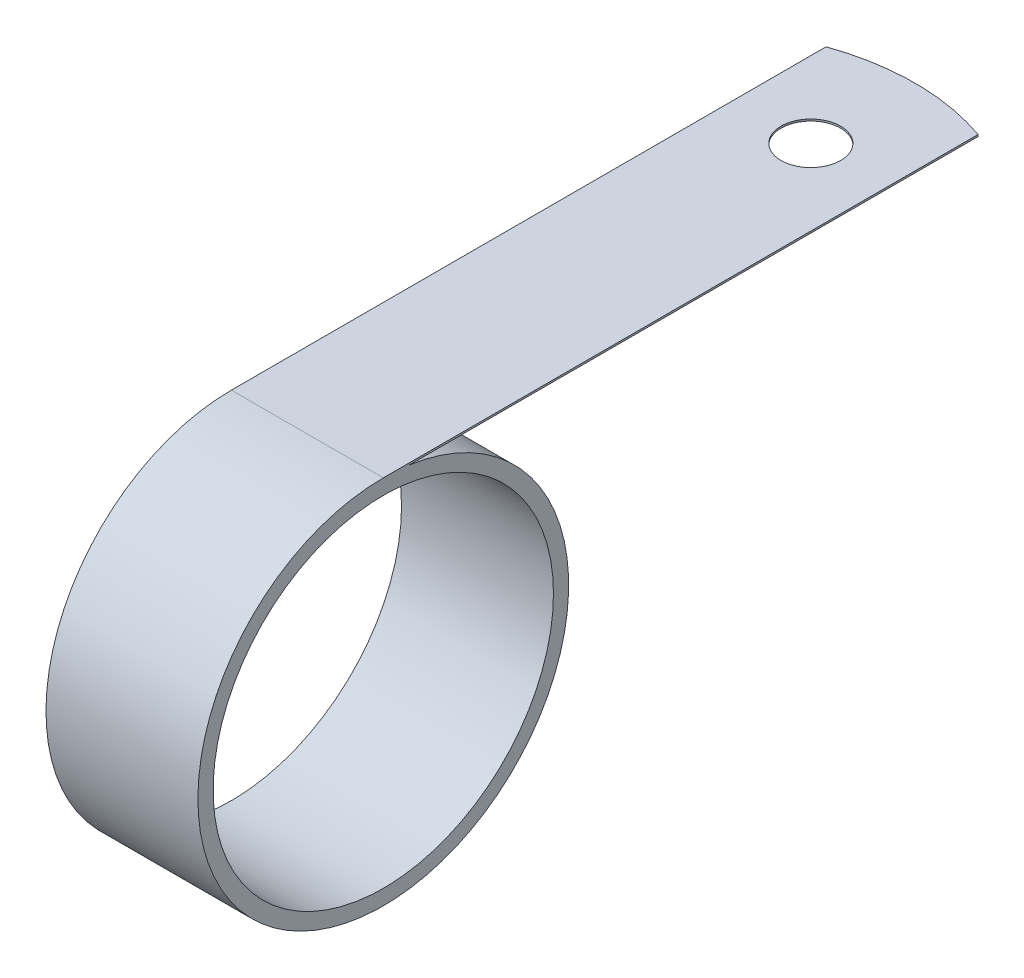
ISO-10303-21;
HEADER;
FILE_DESCRIPTION(('STEP AP214'),'2;1');
FILE_NAME('part.step','',(''),(''),'','','');
FILE_SCHEMA(('AUTOMOTIVE_DESIGN { 1 0 10303 214 1 1 1 1 }'));
ENDSEC;
DATA;
#1=APPLICATION_CONTEXT('core data for automotive mechanical design processes');
#2=APPLICATION_PROTOCOL_DEFINITION('international standard','automotive_design',2000,#1);
#3=PRODUCT_CONTEXT('',#1,'mechanical');
#4=PRODUCT('Part','Part','',(#3));
#5=PRODUCT_RELATED_PRODUCT_CATEGORY('part','',(#4));
#6=PRODUCT_DEFINITION_FORMATION('','',#4);
#7=PRODUCT_DEFINITION_CONTEXT('part definition',#1,'design');
#8=PRODUCT_DEFINITION('design','',#6,#7);
#9=PRODUCT_DEFINITION_SHAPE('','',#8);
#10=(LENGTH_UNIT() NAMED_UNIT(*) SI_UNIT(.MILLI.,.METRE.));
#11=(NAMED_UNIT(*) PLANE_ANGLE_UNIT() SI_UNIT($,.RADIAN.));
#12=(NAMED_UNIT(*) SI_UNIT($,.STERADIAN.) SOLID_ANGLE_UNIT());
#13=UNCERTAINTY_MEASURE_WITH_UNIT(LENGTH_MEASURE(1.E-05),#10,'distance_accuracy_value','');
#14=(GEOMETRIC_REPRESENTATION_CONTEXT(3) GLOBAL_UNCERTAINTY_ASSIGNED_CONTEXT((#13)) GLOBAL_UNIT_ASSIGNED_CONTEXT((#10,
#11,#12)) REPRESENTATION_CONTEXT('',''));
#15=CARTESIAN_POINT('',(0.,0.,0.));
#16=DIRECTION('',(0.,0.,1.));
#17=DIRECTION('',(1.,0.,0.));
#18=AXIS2_PLACEMENT_3D('',#15,#16,#17);
#19=CARTESIAN_POINT('',(6.35,0.,0.));
#20=DIRECTION('',(1.,0.,0.));
#21=DIRECTION('',(0.,0.,-1.));
#22=AXIS2_PLACEMENT_3D('',#19,#20,#21);
#23=PLANE('',#22);
#24=DIRECTION('',(0.,1.,0.));
#25=VECTOR('',#24,1.);
#26=CARTESIAN_POINT('',(6.35,-15.495,-49.7105122421383));
#27=LINE('',#26,#25);
#28=CARTESIAN_POINT('',(6.35,15.3416,-49.7105122421383));
#29=VERTEX_POINT('',#28);
#30=CARTESIAN_POINT('',(6.35,15.494,-49.7105122421383));
#31=VERTEX_POINT('',#30);
#32=EDGE_CURVE('E69',#29,#31,#27,.T.);
#33=ORIENTED_EDGE('',*,*,#32,.T.);
#34=DIRECTION('',(0.,0.,1.));
#35=VECTOR('',#34,1.);
#36=CARTESIAN_POINT('',(6.35,15.494,0.));
#37=LINE('',#36,#35);
#38=CARTESIAN_POINT('',(6.35,15.494,0.));
#39=VERTEX_POINT('',#38);
#40=EDGE_CURVE('E50',#31,#39,#37,.T.);
#41=ORIENTED_EDGE('',*,*,#40,.T.);
#42=CARTESIAN_POINT('',(6.35,0.,0.));
#43=DIRECTION('',(1.,0.,0.));
#44=DIRECTION('',(0.,0.,-1.));
#45=AXIS2_PLACEMENT_3D('',#42,#43,#44);
#46=CIRCLE('',#45,15.494);
#47=CARTESIAN_POINT('',(6.35,15.3416,-2.16779737060455));
#48=VERTEX_POINT('',#47);
#49=EDGE_CURVE('E94',#39,#48,#46,.T.);
#50=ORIENTED_EDGE('',*,*,#49,.T.);
#51=DIRECTION('',(0.,0.,-1.));
#52=VECTOR('',#51,1.);
#53=CARTESIAN_POINT('',(6.35,15.3416,-2.16779737060455));
#54=LINE('',#53,#52);
#55=EDGE_CURVE('E96',#48,#29,#54,.T.);
#56=ORIENTED_EDGE('',*,*,#55,.T.);
#57=EDGE_LOOP('',(#33,#41,#50,#56));
#58=FACE_BOUND('',#57,.T.);
#59=CARTESIAN_POINT('',(6.35,0.,0.));
#60=DIRECTION('',(1.,0.,0.));
#61=DIRECTION('',(0.,0.,-1.));
#62=AXIS2_PLACEMENT_3D('',#59,#60,#61);
#63=CIRCLE('',#62,14.224);
#64=CARTESIAN_POINT('',(6.35,0.,-14.224));
#65=VERTEX_POINT('',#64);
#66=EDGE_CURVE('E105',#65,#65,#63,.T.);
#67=ORIENTED_EDGE('',*,*,#66,.F.);
#68=EDGE_LOOP('',(#67));
#69=FACE_BOUND('',#68,.T.);
#70=ADVANCED_FACE('F33',(#58,#69),#23,.T.);
#71=CARTESIAN_POINT('',(-6.35,0.,0.));
#72=DIRECTION('',(1.,0.,0.));
#73=DIRECTION('',(0.,0.,-1.));
#74=AXIS2_PLACEMENT_3D('',#71,#72,#73);
#75=PLANE('',#74);
#76=DIRECTION('',(0.,0.,1.));
#77=VECTOR('',#76,1.);
#78=CARTESIAN_POINT('',(-6.35,15.494,0.));
#79=LINE('',#78,#77);
#80=CARTESIAN_POINT('',(-6.35,15.494,-49.7105122421383));
#81=VERTEX_POINT('',#80);
#82=CARTESIAN_POINT('',(-6.35,15.494,0.));
#83=VERTEX_POINT('',#82);
#84=EDGE_CURVE('E82',#81,#83,#79,.T.);
#85=ORIENTED_EDGE('',*,*,#84,.F.);
#86=DIRECTION('',(0.,1.,0.));
#87=VECTOR('',#86,1.);
#88=CARTESIAN_POINT('',(-6.35,-15.495,-49.7105122421383));
#89=LINE('',#88,#87);
#90=CARTESIAN_POINT('',(-6.35,15.3416,-49.7105122421383));
#91=VERTEX_POINT('',#90);
#92=EDGE_CURVE('E86',#91,#81,#89,.T.);
#93=ORIENTED_EDGE('',*,*,#92,.F.);
#94=DIRECTION('',(0.,0.,-1.));
#95=VECTOR('',#94,1.);
#96=CARTESIAN_POINT('',(-6.35,15.3416,-2.16779737060455));
#97=LINE('',#96,#95);
#98=CARTESIAN_POINT('',(-6.35,15.3416,-2.16779737060455));
#99=VERTEX_POINT('',#98);
#100=EDGE_CURVE('E62',#99,#91,#97,.T.);
#101=ORIENTED_EDGE('',*,*,#100,.F.);
#102=CARTESIAN_POINT('',(-6.35,0.,0.));
#103=DIRECTION('',(1.,0.,0.));
#104=DIRECTION('',(0.,0.,-1.));
#105=AXIS2_PLACEMENT_3D('',#102,#103,#104);
#106=CIRCLE('',#105,15.494);
#107=EDGE_CURVE('E93',#83,#99,#106,.T.);
#108=ORIENTED_EDGE('',*,*,#107,.F.);
#109=EDGE_LOOP('',(#85,#93,#101,#108));
#110=FACE_BOUND('',#109,.T.);
#111=CARTESIAN_POINT('',(-6.35,0.,0.));
#112=DIRECTION('',(1.,0.,0.));
#113=DIRECTION('',(0.,0.,-1.));
#114=AXIS2_PLACEMENT_3D('',#111,#112,#113);
#115=CIRCLE('',#114,14.224);
#116=CARTESIAN_POINT('',(-6.35,0.,-14.224));
#117=VERTEX_POINT('',#116);
#118=EDGE_CURVE('E108',#117,#117,#115,.T.);
#119=ORIENTED_EDGE('',*,*,#118,.T.);
#120=EDGE_LOOP('',(#119));
#121=FACE_BOUND('',#120,.T.);
#122=ADVANCED_FACE('F90',(#110,#121),#75,.F.);
#123=CARTESIAN_POINT('',(6.35,0.,0.));
#124=DIRECTION('',(-1.,0.,0.));
#125=DIRECTION('',(0.,0.,1.));
#126=AXIS2_PLACEMENT_3D('',#123,#124,#125);
#127=CYLINDRICAL_SURFACE('',#126,15.494);
#128=ORIENTED_EDGE('',*,*,#107,.T.);
#129=DIRECTION('',(-1.,0.,0.));
#130=VECTOR('',#129,1.);
#131=CARTESIAN_POINT('',(6.35,15.3416,-2.16779737060455));
#132=LINE('',#131,#130);
#133=EDGE_CURVE('E11',#48,#99,#132,.T.);
#134=ORIENTED_EDGE('',*,*,#133,.F.);
#135=ORIENTED_EDGE('',*,*,#49,.F.);
#136=DIRECTION('',(-1.,0.,0.));
#137=VECTOR('',#136,1.);
#138=CARTESIAN_POINT('',(6.35,15.494,0.));
#139=LINE('',#138,#137);
#140=EDGE_CURVE('E42',#39,#83,#139,.T.);
#141=ORIENTED_EDGE('',*,*,#140,.T.);
#142=EDGE_LOOP('',(#128,#134,#135,#141));
#143=FACE_BOUND('',#142,.T.);
#144=ADVANCED_FACE('F35',(#143),#127,.T.);
#145=CARTESIAN_POINT('',(6.35,15.3416,-2.16779737060455));
#146=DIRECTION('',(0.,1.,0.));
#147=DIRECTION('',(0.,0.,1.));
#148=AXIS2_PLACEMENT_3D('',#145,#146,#147);
#149=PLANE('',#148);
#150=CARTESIAN_POINT('',(0.,15.3416,-42.0878));
#151=DIRECTION('',(0.,1.,0.));
#152=DIRECTION('',(0.,0.,1.));
#153=AXIS2_PLACEMENT_3D('',#150,#151,#152);
#154=CIRCLE('',#153,2.4892);
#155=CARTESIAN_POINT('',(0.,15.3416,-39.5986));
#156=VERTEX_POINT('',#155);
#157=EDGE_CURVE('E117',#156,#156,#154,.F.);
#158=ORIENTED_EDGE('',*,*,#157,.F.);
#159=EDGE_LOOP('',(#158));
#160=FACE_BOUND('',#159,.T.);
#161=ORIENTED_EDGE('',*,*,#100,.T.);
#162=CARTESIAN_POINT('',(0.,15.3416,-31.75));
#163=DIRECTION('',(0.,1.,0.));
#164=DIRECTION('',(0.,0.,1.));
#165=AXIS2_PLACEMENT_3D('',#162,#163,#164);
#166=CIRCLE('',#165,19.05);
#167=EDGE_CURVE('E84',#29,#91,#166,.T.);
#168=ORIENTED_EDGE('',*,*,#167,.F.);
#169=ORIENTED_EDGE('',*,*,#55,.F.);
#170=ORIENTED_EDGE('',*,*,#133,.T.);
#171=EDGE_LOOP('',(#161,#168,#169,#170));
#172=FACE_BOUND('',#171,.T.);
#173=ADVANCED_FACE('F128',(#160,#172),#149,.F.);
#174=CARTESIAN_POINT('',(6.35,15.494,0.));
#175=DIRECTION('',(0.,-1.,0.));
#176=DIRECTION('',(0.,0.,-1.));
#177=AXIS2_PLACEMENT_3D('',#174,#175,#176);
#178=PLANE('',#177);
#179=CARTESIAN_POINT('',(0.,15.494,-42.0878));
#180=DIRECTION('',(0.,1.,0.));
#181=DIRECTION('',(0.,0.,1.));
#182=AXIS2_PLACEMENT_3D('',#179,#180,#181);
#183=CIRCLE('',#182,2.4892);
#184=CARTESIAN_POINT('',(0.,15.494,-39.5986));
#185=VERTEX_POINT('',#184);
#186=EDGE_CURVE('E88',#185,#185,#183,.T.);
#187=ORIENTED_EDGE('',*,*,#186,.F.);
#188=EDGE_LOOP('',(#187));
#189=FACE_BOUND('',#188,.T.);
#190=CARTESIAN_POINT('',(0.,15.494,-31.75));
#191=DIRECTION('',(0.,-1.,0.));
#192=DIRECTION('',(0.,0.,1.));
#193=AXIS2_PLACEMENT_3D('',#190,#191,#192);
#194=CIRCLE('',#193,19.05);
#195=EDGE_CURVE('E78',#81,#31,#194,.T.);
#196=ORIENTED_EDGE('',*,*,#195,.F.);
#197=ORIENTED_EDGE('',*,*,#84,.T.);
#198=ORIENTED_EDGE('',*,*,#140,.F.);
#199=ORIENTED_EDGE('',*,*,#40,.F.);
#200=EDGE_LOOP('',(#196,#197,#198,#199));
#201=FACE_BOUND('',#200,.T.);
#202=ADVANCED_FACE('F80',(#189,#201),#178,.F.);
#203=CARTESIAN_POINT('',(6.35,0.,0.));
#204=DIRECTION('',(-1.,0.,0.));
#205=DIRECTION('',(0.,0.,1.));
#206=AXIS2_PLACEMENT_3D('',#203,#204,#205);
#207=CYLINDRICAL_SURFACE('',#206,14.224);
#208=ORIENTED_EDGE('',*,*,#66,.T.);
#209=EDGE_LOOP('',(#208));
#210=FACE_BOUND('',#209,.T.);
#211=ORIENTED_EDGE('',*,*,#118,.F.);
#212=EDGE_LOOP('',(#211));
#213=FACE_BOUND('',#212,.T.);
#214=ADVANCED_FACE('F127',(#210,#213),#207,.F.);
#215=CARTESIAN_POINT('',(0.,-15.495,-31.75));
#216=DIRECTION('',(0.,1.,0.));
#217=DIRECTION('',(0.,0.,1.));
#218=AXIS2_PLACEMENT_3D('',#215,#216,#217);
#219=CYLINDRICAL_SURFACE('',#218,19.05);
#220=ORIENTED_EDGE('',*,*,#167,.T.);
#221=ORIENTED_EDGE('',*,*,#92,.T.);
#222=ORIENTED_EDGE('',*,*,#195,.T.);
#223=ORIENTED_EDGE('',*,*,#32,.F.);
#224=EDGE_LOOP('',(#220,#221,#222,#223));
#225=FACE_BOUND('',#224,.T.);
#226=ADVANCED_FACE('F87',(#225),#219,.T.);
#227=CARTESIAN_POINT('',(0.,-15.495,-42.0878));
#228=DIRECTION('',(0.,1.,0.));
#229=DIRECTION('',(0.,0.,1.));
#230=AXIS2_PLACEMENT_3D('',#227,#228,#229);
#231=CYLINDRICAL_SURFACE('',#230,2.4892);
#232=ORIENTED_EDGE('',*,*,#186,.T.);
#233=EDGE_LOOP('',(#232));
#234=FACE_BOUND('',#233,.T.);
#235=ORIENTED_EDGE('',*,*,#157,.T.);
#236=EDGE_LOOP('',(#235));
#237=FACE_BOUND('',#236,.T.);
#238=ADVANCED_FACE('F123',(#234,#237),#231,.F.);
#239=CLOSED_SHELL('',(#70,#122,#144,#173,#202,#214,#226,#238));
#240=MANIFOLD_SOLID_BREP('B2',#239);
#241=ADVANCED_BREP_SHAPE_REPRESENTATION('',(#18,#240),#14);
#242=SHAPE_DEFINITION_REPRESENTATION(#9,#241);
ENDSEC;
END-ISO-10303-21;
